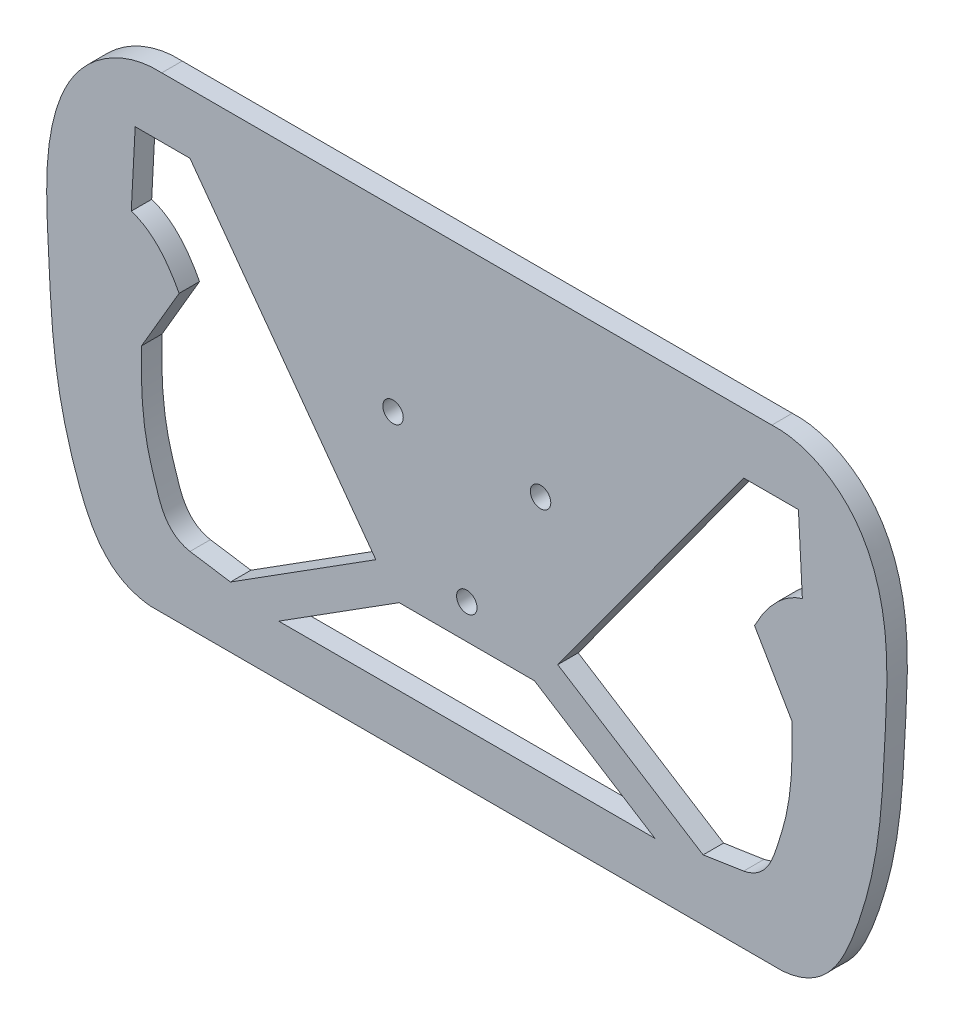
ISO-10303-21;
HEADER;
FILE_DESCRIPTION(('STEP AP214'),'2;1');
FILE_NAME('part.step','',(''),(''),'','','');
FILE_SCHEMA(('AUTOMOTIVE_DESIGN { 1 0 10303 214 1 1 1 1 }'));
ENDSEC;
DATA;
#1=APPLICATION_CONTEXT('core data for automotive mechanical design processes');
#2=APPLICATION_PROTOCOL_DEFINITION('international standard','automotive_design',2000,#1);
#3=PRODUCT_CONTEXT('',#1,'mechanical');
#4=PRODUCT('Part','Part','',(#3));
#5=PRODUCT_RELATED_PRODUCT_CATEGORY('part','',(#4));
#6=PRODUCT_DEFINITION_FORMATION('','',#4);
#7=PRODUCT_DEFINITION_CONTEXT('part definition',#1,'design');
#8=PRODUCT_DEFINITION('design','',#6,#7);
#9=PRODUCT_DEFINITION_SHAPE('','',#8);
#10=(LENGTH_UNIT() NAMED_UNIT(*) SI_UNIT(.MILLI.,.METRE.));
#11=(NAMED_UNIT(*) PLANE_ANGLE_UNIT() SI_UNIT($,.RADIAN.));
#12=(NAMED_UNIT(*) SI_UNIT($,.STERADIAN.) SOLID_ANGLE_UNIT());
#13=UNCERTAINTY_MEASURE_WITH_UNIT(LENGTH_MEASURE(1.E-05),#10,'distance_accuracy_value','');
#14=(GEOMETRIC_REPRESENTATION_CONTEXT(3) GLOBAL_UNCERTAINTY_ASSIGNED_CONTEXT((#13)) GLOBAL_UNIT_ASSIGNED_CONTEXT((#10,
#11,#12)) REPRESENTATION_CONTEXT('',''));
#15=CARTESIAN_POINT('',(0.,0.,0.));
#16=DIRECTION('',(0.,0.,1.));
#17=DIRECTION('',(1.,0.,0.));
#18=AXIS2_PLACEMENT_3D('',#15,#16,#17);
#19=CARTESIAN_POINT('',(122.634661360658,-0.641249025260309,6.));
#20=DIRECTION('',(0.,0.,1.));
#21=DIRECTION('',(1.,0.,0.));
#22=AXIS2_PLACEMENT_3D('',#19,#20,#21);
#23=PLANE('',#22);
#24=CARTESIAN_POINT('',(21.650635094611,12.5,6.));
#25=DIRECTION('',(0.,0.,1.));
#26=DIRECTION('',(1.,0.,0.));
#27=AXIS2_PLACEMENT_3D('',#24,#25,#26);
#28=CIRCLE('',#27,3.00000000000001);
#29=CARTESIAN_POINT('',(24.650635094611,12.5,6.));
#30=VERTEX_POINT('',#29);
#31=EDGE_CURVE('E433',#30,#30,#28,.T.);
#32=ORIENTED_EDGE('',*,*,#31,.F.);
#33=EDGE_LOOP('',(#32));
#34=FACE_BOUND('',#33,.T.);
#35=DIRECTION('',(-0.504883315037953,0.863187603129405,0.));
#36=VECTOR('',#35,1.);
#37=CARTESIAN_POINT('',(84.450971740374,11.2087465068864,6.));
#38=LINE('',#37,#36);
#39=CARTESIAN_POINT('',(95.4766910109148,-7.6416767621028,6.));
#40=VERTEX_POINT('',#39);
#41=CARTESIAN_POINT('',(84.450971740374,11.2087465068864,6.));
#42=VERTEX_POINT('',#41);
#43=EDGE_CURVE('E305',#40,#42,#38,.T.);
#44=ORIENTED_EDGE('',*,*,#43,.F.);
#45=CARTESIAN_POINT('',(81.2606265191885,-52.808002251328,6.));
#46=CARTESIAN_POINT('',(87.8145390836592,-51.4531260826305,6.));
#47=CARTESIAN_POINT('',(90.619630403705,-43.3006040680581,6.));
#48=CARTESIAN_POINT('',(95.5023536128132,-27.4781434991335,6.));
#49=CARTESIAN_POINT('',(95.6524020822301,-15.8577347754942,6.));
#50=CARTESIAN_POINT('',(95.4766910109148,-7.6416767621028,6.));
#51=B_SPLINE_CURVE_WITH_KNOTS('',3,(#45,#46,#47,#48,#49,#50),.UNSPECIFIED.,.F.,.F.,(4,1,1,4),
(0.,0.321849899827319,0.498947056420812,1.),.UNSPECIFIED.);
#52=CARTESIAN_POINT('',(81.2606265191884,-52.808002251328,6.));
#53=VERTEX_POINT('',#52);
#54=EDGE_CURVE('E356',#53,#40,#51,.T.);
#55=ORIENTED_EDGE('',*,*,#54,.F.);
#56=DIRECTION('',(0.988480113090915,0.151350804503217,0.));
#57=VECTOR('',#56,1.);
#58=CARTESIAN_POINT('',(69.3700327766013,-54.6286265665043,6.));
#59=LINE('',#58,#57);
#60=CARTESIAN_POINT('',(69.3700327766013,-54.6286265665043,6.));
#61=VERTEX_POINT('',#60);
#62=EDGE_CURVE('E318',#61,#53,#59,.T.);
#63=ORIENTED_EDGE('',*,*,#62,.F.);
#64=DIRECTION('',(0.844973215996909,-0.534808623946773,0.));
#65=VECTOR('',#64,1.);
#66=CARTESIAN_POINT('',(26.6942119899972,-27.6178331370871,6.));
#67=LINE('',#66,#65);
#68=CARTESIAN_POINT('',(26.6942119899972,-27.6178331370871,6.));
#69=VERTEX_POINT('',#68);
#70=EDGE_CURVE('E315',#69,#61,#67,.T.);
#71=ORIENTED_EDGE('',*,*,#70,.F.);
#72=DIRECTION('',(-0.589608563493928,-0.807689136892794,0.));
#73=VECTOR('',#72,1.);
#74=CARTESIAN_POINT('',(81.2606265191884,47.1312512270356,6.));
#75=LINE('',#74,#73);
#76=CARTESIAN_POINT('',(81.2606265191884,47.1312512270356,6.));
#77=VERTEX_POINT('',#76);
#78=EDGE_CURVE('E313',#77,#69,#75,.T.);
#79=ORIENTED_EDGE('',*,*,#78,.F.);
#80=DIRECTION('',(-1.,0.,0.));
#81=VECTOR('',#80,1.);
#82=CARTESIAN_POINT('',(97.3439499196354,47.1312512270356,6.));
#83=LINE('',#82,#81);
#84=CARTESIAN_POINT('',(97.3439499196354,47.1312512270356,6.));
#85=VERTEX_POINT('',#84);
#86=EDGE_CURVE('E311',#85,#77,#83,.T.);
#87=ORIENTED_EDGE('',*,*,#86,.F.);
#88=DIRECTION('',(-0.0523474842616533,0.998628930529992,0.));
#89=VECTOR('',#88,1.);
#90=CARTESIAN_POINT('',(97.3439499196354,47.1312512270356,6.));
#91=LINE('',#90,#89);
#92=CARTESIAN_POINT('',(98.4998721012244,25.0798126859539,6.));
#93=VERTEX_POINT('',#92);
#94=EDGE_CURVE('E304',#93,#85,#91,.T.);
#95=ORIENTED_EDGE('',*,*,#94,.F.);
#96=CARTESIAN_POINT('',(84.450971740374,11.2087465068864,6.));
#97=CARTESIAN_POINT('',(87.513780679481,17.0132915724179,6.));
#98=CARTESIAN_POINT('',(91.8936783987908,23.0577499282513,6.));
#99=CARTESIAN_POINT('',(98.4998721012244,25.0798126859539,6.));
#100=B_SPLINE_CURVE_WITH_KNOTS('',3,(#96,#97,#98,#99),.UNSPECIFIED.,.F.,.F.,(4,4),(0.,1.),.UNSPECIFIED.);
#101=EDGE_CURVE('E298',#42,#93,#100,.T.);
#102=ORIENTED_EDGE('',*,*,#101,.F.);
#103=EDGE_LOOP('',(#44,#55,#63,#71,#79,#87,#95,#102));
#104=FACE_BOUND('',#103,.T.);
#105=CARTESIAN_POINT('',(92.8418712487192,-72.5039417047034,6.));
#106=CARTESIAN_POINT('',(105.56811714284,-71.3121853731023,6.));
#107=CARTESIAN_POINT('',(114.338873962336,-53.6273241254987,6.));
#108=CARTESIAN_POINT('',(121.528600594417,-25.8175272471951,6.));
#109=CARTESIAN_POINT('',(122.771348874205,4.03813336720382,6.));
#110=CARTESIAN_POINT('',(124.422620363698,32.0211174561286,6.));
#111=CARTESIAN_POINT('',(113.814805390092,57.2845277569239,6.));
#112=CARTESIAN_POINT('',(98.9087189304596,65.2212880524899,6.));
#113=CARTESIAN_POINT('',(89.5433504103007,64.7223618911426,6.));
#114=B_SPLINE_CURVE_WITH_KNOTS('',3,(#105,#106,#107,#108,#109,#110,#111,#112,#113),
.UNSPECIFIED.,.F.,.F.,(4,1,1,1,1,1,4),(0.,0.190671726831978,0.335209527936945,0.520866190364124,
0.729221785484658,0.832795674392145,1.),.UNSPECIFIED.);
#115=CARTESIAN_POINT('',(92.8418712487192,-72.5039417047034,6.));
#116=VERTEX_POINT('',#115);
#117=CARTESIAN_POINT('',(89.5433504103007,64.7223618911426,6.));
#118=VERTEX_POINT('',#117);
#119=EDGE_CURVE('E374',#116,#118,#114,.T.);
#120=ORIENTED_EDGE('',*,*,#119,.T.);
#121=DIRECTION('',(-1.,0.,0.));
#122=VECTOR('',#121,1.);
#123=CARTESIAN_POINT('',(-89.5433504103007,64.7223618911426,6.));
#124=LINE('',#123,#122);
#125=CARTESIAN_POINT('',(-89.5433504103007,64.7223618911426,6.));
#126=VERTEX_POINT('',#125);
#127=EDGE_CURVE('E380',#118,#126,#124,.T.);
#128=ORIENTED_EDGE('',*,*,#127,.T.);
#129=CARTESIAN_POINT('',(-89.5433504103007,64.7223618911426,6.));
#130=CARTESIAN_POINT('',(-98.9087189304596,65.2212880524899,6.));
#131=CARTESIAN_POINT('',(-113.814805390092,57.2845277569239,6.));
#132=CARTESIAN_POINT('',(-124.422620363698,32.0211174561286,6.));
#133=CARTESIAN_POINT('',(-122.771348874205,4.03813336720382,6.));
#134=CARTESIAN_POINT('',(-121.528600594417,-25.8175272471951,6.));
#135=CARTESIAN_POINT('',(-114.338873962336,-53.6273241254987,6.));
#136=CARTESIAN_POINT('',(-105.56811714284,-71.3121853731023,6.));
#137=CARTESIAN_POINT('',(-92.8418712487192,-72.5039417047034,6.));
#138=B_SPLINE_CURVE_WITH_KNOTS('',3,(#129,#130,#131,#132,#133,#134,#135,#136,#137),
.UNSPECIFIED.,.F.,.F.,(4,1,1,1,1,1,4),(0.,0.167204325607855,0.270778214515342,0.479133809635876,
0.664790472063055,0.809328273168022,1.),.UNSPECIFIED.);
#139=CARTESIAN_POINT('',(-92.8418712487192,-72.5039417047034,6.));
#140=VERTEX_POINT('',#139);
#141=EDGE_CURVE('E386',#126,#140,#138,.T.);
#142=ORIENTED_EDGE('',*,*,#141,.T.);
#143=DIRECTION('',(1.,0.,0.));
#144=VECTOR('',#143,1.);
#145=CARTESIAN_POINT('',(92.8418712487192,-72.5039417047034,6.));
#146=LINE('',#145,#144);
#147=EDGE_CURVE('E391',#140,#116,#146,.T.);
#148=ORIENTED_EDGE('',*,*,#147,.T.);
#149=EDGE_LOOP('',(#120,#128,#142,#148));
#150=FACE_BOUND('',#149,.T.);
#151=CARTESIAN_POINT('',(-21.650635094611,12.5,6.));
#152=DIRECTION('',(0.,0.,1.));
#153=DIRECTION('',(1.,0.,0.));
#154=AXIS2_PLACEMENT_3D('',#151,#152,#153);
#155=CIRCLE('',#154,3.00000000000001);
#156=CARTESIAN_POINT('',(-18.650635094611,12.5,6.));
#157=VERTEX_POINT('',#156);
#158=EDGE_CURVE('E327',#157,#157,#155,.T.);
#159=ORIENTED_EDGE('',*,*,#158,.F.);
#160=EDGE_LOOP('',(#159));
#161=FACE_BOUND('',#160,.T.);
#162=CARTESIAN_POINT('',(0.,-25.,6.));
#163=DIRECTION('',(0.,0.,1.));
#164=DIRECTION('',(1.,0.,0.));
#165=AXIS2_PLACEMENT_3D('',#162,#163,#164);
#166=CIRCLE('',#165,3.);
#167=CARTESIAN_POINT('',(3.,-25.,6.));
#168=VERTEX_POINT('',#167);
#169=EDGE_CURVE('E439',#168,#168,#166,.T.);
#170=ORIENTED_EDGE('',*,*,#169,.F.);
#171=EDGE_LOOP('',(#170));
#172=FACE_BOUND('',#171,.T.);
#173=DIRECTION('',(-1.,0.,0.));
#174=VECTOR('',#173,1.);
#175=CARTESIAN_POINT('',(-19.8616144286216,-35.1279740268568,6.));
#176=LINE('',#175,#174);
#177=CARTESIAN_POINT('',(19.8616144286216,-35.1279740268568,6.));
#178=VERTEX_POINT('',#177);
#179=CARTESIAN_POINT('',(-19.8616144286216,-35.1279740268568,6.));
#180=VERTEX_POINT('',#179);
#181=EDGE_CURVE('E474',#178,#180,#176,.T.);
#182=ORIENTED_EDGE('',*,*,#181,.F.);
#183=DIRECTION('',(-0.844973215996909,0.534808623946773,0.));
#184=VECTOR('',#183,1.);
#185=CARTESIAN_POINT('',(19.8616144286216,-35.1279740268568,6.));
#186=LINE('',#185,#184);
#187=CARTESIAN_POINT('',(55.2146220713604,-57.5039417047034,6.));
#188=VERTEX_POINT('',#187);
#189=EDGE_CURVE('E461',#188,#178,#186,.T.);
#190=ORIENTED_EDGE('',*,*,#189,.F.);
#191=DIRECTION('',(1.,0.,0.));
#192=VECTOR('',#191,1.);
#193=CARTESIAN_POINT('',(55.2146220713604,-57.5039417047034,6.));
#194=LINE('',#193,#192);
#195=CARTESIAN_POINT('',(-55.2146220713604,-57.5039417047034,6.));
#196=VERTEX_POINT('',#195);
#197=EDGE_CURVE('E457',#196,#188,#194,.T.);
#198=ORIENTED_EDGE('',*,*,#197,.F.);
#199=DIRECTION('',(-0.844973215996909,-0.534808623946773,0.));
#200=VECTOR('',#199,1.);
#201=CARTESIAN_POINT('',(-19.8616144286216,-35.1279740268568,6.));
#202=LINE('',#201,#200);
#203=EDGE_CURVE('E471',#180,#196,#202,.T.);
#204=ORIENTED_EDGE('',*,*,#203,.F.);
#205=EDGE_LOOP('',(#182,#190,#198,#204));
#206=FACE_BOUND('',#205,.T.);
#207=DIRECTION('',(-0.504883315037953,-0.863187603129405,0.));
#208=VECTOR('',#207,1.);
#209=CARTESIAN_POINT('',(-84.450971740374,11.2087465068864,6.));
#210=LINE('',#209,#208);
#211=CARTESIAN_POINT('',(-84.450971740374,11.2087465068864,6.));
#212=VERTEX_POINT('',#211);
#213=CARTESIAN_POINT('',(-95.4766910109148,-7.6416767621028,6.));
#214=VERTEX_POINT('',#213);
#215=EDGE_CURVE('E203',#212,#214,#210,.T.);
#216=ORIENTED_EDGE('',*,*,#215,.F.);
#217=CARTESIAN_POINT('',(-98.4998721012244,25.0798126859539,6.));
#218=CARTESIAN_POINT('',(-91.8936783987908,23.0577499282513,6.));
#219=CARTESIAN_POINT('',(-87.5137806794809,17.0132915724179,6.));
#220=CARTESIAN_POINT('',(-84.450971740374,11.2087465068864,6.));
#221=B_SPLINE_CURVE_WITH_KNOTS('',3,(#217,#218,#219,#220),.UNSPECIFIED.,.F.,.F.,(4,4),(0.,1.),.UNSPECIFIED.);
#222=CARTESIAN_POINT('',(-98.4998721012244,25.0798126859539,6.));
#223=VERTEX_POINT('',#222);
#224=EDGE_CURVE('E195',#223,#212,#221,.T.);
#225=ORIENTED_EDGE('',*,*,#224,.F.);
#226=DIRECTION('',(-0.0523474842616533,-0.998628930529992,0.));
#227=VECTOR('',#226,1.);
#228=CARTESIAN_POINT('',(-97.3439499196354,47.1312512270356,6.));
#229=LINE('',#228,#227);
#230=CARTESIAN_POINT('',(-97.3439499196355,47.1312512270356,6.));
#231=VERTEX_POINT('',#230);
#232=EDGE_CURVE('E488',#231,#223,#229,.T.);
#233=ORIENTED_EDGE('',*,*,#232,.F.);
#234=DIRECTION('',(-1.,0.,0.));
#235=VECTOR('',#234,1.);
#236=CARTESIAN_POINT('',(-97.3439499196354,47.1312512270356,6.));
#237=LINE('',#236,#235);
#238=CARTESIAN_POINT('',(-81.2606265191884,47.1312512270356,6.));
#239=VERTEX_POINT('',#238);
#240=EDGE_CURVE('E519',#239,#231,#237,.T.);
#241=ORIENTED_EDGE('',*,*,#240,.F.);
#242=DIRECTION('',(-0.589608563493928,0.807689136892794,0.));
#243=VECTOR('',#242,1.);
#244=CARTESIAN_POINT('',(-81.2606265191884,47.1312512270356,6.));
#245=LINE('',#244,#243);
#246=CARTESIAN_POINT('',(-26.6942119899972,-27.6178331370871,6.));
#247=VERTEX_POINT('',#246);
#248=EDGE_CURVE('E521',#247,#239,#245,.T.);
#249=ORIENTED_EDGE('',*,*,#248,.F.);
#250=DIRECTION('',(0.844973215996909,0.534808623946773,0.));
#251=VECTOR('',#250,1.);
#252=CARTESIAN_POINT('',(-26.6942119899972,-27.6178331370871,6.));
#253=LINE('',#252,#251);
#254=CARTESIAN_POINT('',(-69.3700327766013,-54.6286265665043,6.));
#255=VERTEX_POINT('',#254);
#256=EDGE_CURVE('E522',#255,#247,#253,.T.);
#257=ORIENTED_EDGE('',*,*,#256,.F.);
#258=DIRECTION('',(0.988480113090915,-0.151350804503217,0.));
#259=VECTOR('',#258,1.);
#260=CARTESIAN_POINT('',(-69.3700327766013,-54.6286265665043,6.));
#261=LINE('',#260,#259);
#262=CARTESIAN_POINT('',(-81.2606265191884,-52.808002251328,6.));
#263=VERTEX_POINT('',#262);
#264=EDGE_CURVE('E218',#263,#255,#261,.T.);
#265=ORIENTED_EDGE('',*,*,#264,.F.);
#266=CARTESIAN_POINT('',(-95.4766910109148,-7.6416767621028,6.));
#267=CARTESIAN_POINT('',(-95.6524020822301,-15.8577347754942,6.));
#268=CARTESIAN_POINT('',(-95.5023536128132,-27.4781434991335,6.));
#269=CARTESIAN_POINT('',(-90.619630403705,-43.3006040680581,6.));
#270=CARTESIAN_POINT('',(-87.8145390836592,-51.4531260826305,6.));
#271=CARTESIAN_POINT('',(-81.2606265191885,-52.808002251328,6.));
#272=B_SPLINE_CURVE_WITH_KNOTS('',3,(#266,#267,#268,#269,#270,#271),.UNSPECIFIED.,.F.,.F.,(4,1,
1,4),(0.,0.501052943579188,0.678150100172681,1.),.UNSPECIFIED.);
#273=EDGE_CURVE('E216',#214,#263,#272,.T.);
#274=ORIENTED_EDGE('',*,*,#273,.F.);
#275=EDGE_LOOP('',(#216,#225,#233,#241,#249,#257,#265,#274));
#276=FACE_BOUND('',#275,.T.);
#277=ADVANCED_FACE('F33',(#34,#104,#150,#161,#172,#206,#276),#23,.T.);
#278=CARTESIAN_POINT('',(122.634661360658,-0.641249025260309,0.));
#279=DIRECTION('',(0.,0.,1.));
#280=DIRECTION('',(1.,0.,0.));
#281=AXIS2_PLACEMENT_3D('',#278,#279,#280);
#282=PLANE('',#281);
#283=DIRECTION('',(-0.844973215996909,0.534808623946773,0.));
#284=VECTOR('',#283,1.);
#285=CARTESIAN_POINT('',(19.8616144286216,-35.1279740268568,0.));
#286=LINE('',#285,#284);
#287=CARTESIAN_POINT('',(55.2146220713604,-57.5039417047034,0.));
#288=VERTEX_POINT('',#287);
#289=CARTESIAN_POINT('',(19.8616144286216,-35.1279740268568,0.));
#290=VERTEX_POINT('',#289);
#291=EDGE_CURVE('E211',#288,#290,#286,.T.);
#292=ORIENTED_EDGE('',*,*,#291,.T.);
#293=DIRECTION('',(-1.,0.,0.));
#294=VECTOR('',#293,1.);
#295=CARTESIAN_POINT('',(-19.8616144286216,-35.1279740268568,0.));
#296=LINE('',#295,#294);
#297=CARTESIAN_POINT('',(-19.8616144286216,-35.1279740268568,0.));
#298=VERTEX_POINT('',#297);
#299=EDGE_CURVE('E465',#290,#298,#296,.T.);
#300=ORIENTED_EDGE('',*,*,#299,.T.);
#301=DIRECTION('',(-0.844973215996909,-0.534808623946773,0.));
#302=VECTOR('',#301,1.);
#303=CARTESIAN_POINT('',(-19.8616144286216,-35.1279740268568,0.));
#304=LINE('',#303,#302);
#305=CARTESIAN_POINT('',(-55.2146220713604,-57.5039417047034,0.));
#306=VERTEX_POINT('',#305);
#307=EDGE_CURVE('E462',#298,#306,#304,.T.);
#308=ORIENTED_EDGE('',*,*,#307,.T.);
#309=DIRECTION('',(1.,0.,0.));
#310=VECTOR('',#309,1.);
#311=CARTESIAN_POINT('',(55.2146220713604,-57.5039417047034,0.));
#312=LINE('',#311,#310);
#313=EDGE_CURVE('E458',#306,#288,#312,.T.);
#314=ORIENTED_EDGE('',*,*,#313,.T.);
#315=EDGE_LOOP('',(#292,#300,#308,#314));
#316=FACE_BOUND('',#315,.T.);
#317=CARTESIAN_POINT('',(92.8418712487192,-72.5039417047034,0.));
#318=CARTESIAN_POINT('',(105.56811714284,-71.3121853731023,0.));
#319=CARTESIAN_POINT('',(114.338873962336,-53.6273241254987,0.));
#320=CARTESIAN_POINT('',(121.528600594417,-25.8175272471951,0.));
#321=CARTESIAN_POINT('',(122.771348874205,4.03813336720382,0.));
#322=CARTESIAN_POINT('',(124.422620363698,32.0211174561286,0.));
#323=CARTESIAN_POINT('',(113.814805390092,57.2845277569239,0.));
#324=CARTESIAN_POINT('',(98.9087189304596,65.2212880524899,0.));
#325=CARTESIAN_POINT('',(89.5433504103007,64.7223618911426,0.));
#326=B_SPLINE_CURVE_WITH_KNOTS('',3,(#317,#318,#319,#320,#321,#322,#323,#324,#325),
.UNSPECIFIED.,.F.,.F.,(4,1,1,1,1,1,4),(0.,0.190671726831978,0.335209527936945,0.520866190364124,
0.729221785484658,0.832795674392145,1.),.UNSPECIFIED.);
#327=CARTESIAN_POINT('',(92.8418712487192,-72.5039417047034,0.));
#328=VERTEX_POINT('',#327);
#329=CARTESIAN_POINT('',(89.5433504103007,64.7223618911426,0.));
#330=VERTEX_POINT('',#329);
#331=EDGE_CURVE('E373',#328,#330,#326,.T.);
#332=ORIENTED_EDGE('',*,*,#331,.F.);
#333=DIRECTION('',(1.,0.,0.));
#334=VECTOR('',#333,1.);
#335=CARTESIAN_POINT('',(92.8418712487192,-72.5039417047034,0.));
#336=LINE('',#335,#334);
#337=CARTESIAN_POINT('',(-92.8418712487192,-72.5039417047034,0.));
#338=VERTEX_POINT('',#337);
#339=EDGE_CURVE('E381',#338,#328,#336,.T.);
#340=ORIENTED_EDGE('',*,*,#339,.F.);
#341=CARTESIAN_POINT('',(-89.5433504103007,64.7223618911426,0.));
#342=CARTESIAN_POINT('',(-98.9087189304596,65.2212880524899,0.));
#343=CARTESIAN_POINT('',(-113.814805390092,57.2845277569239,0.));
#344=CARTESIAN_POINT('',(-124.422620363698,32.0211174561286,0.));
#345=CARTESIAN_POINT('',(-122.771348874205,4.03813336720382,0.));
#346=CARTESIAN_POINT('',(-121.528600594417,-25.8175272471951,0.));
#347=CARTESIAN_POINT('',(-114.338873962336,-53.6273241254987,0.));
#348=CARTESIAN_POINT('',(-105.56811714284,-71.3121853731023,0.));
#349=CARTESIAN_POINT('',(-92.8418712487192,-72.5039417047034,0.));
#350=B_SPLINE_CURVE_WITH_KNOTS('',3,(#341,#342,#343,#344,#345,#346,#347,#348,#349),
.UNSPECIFIED.,.F.,.F.,(4,1,1,1,1,1,4),(0.,0.167204325607855,0.270778214515342,0.479133809635876,
0.664790472063055,0.809328273168022,1.),.UNSPECIFIED.);
#351=CARTESIAN_POINT('',(-89.5433504103007,64.7223618911426,0.));
#352=VERTEX_POINT('',#351);
#353=EDGE_CURVE('E738',#352,#338,#350,.T.);
#354=ORIENTED_EDGE('',*,*,#353,.F.);
#355=DIRECTION('',(-1.,0.,0.));
#356=VECTOR('',#355,1.);
#357=CARTESIAN_POINT('',(-89.5433504103007,64.7223618911426,0.));
#358=LINE('',#357,#356);
#359=EDGE_CURVE('E744',#330,#352,#358,.T.);
#360=ORIENTED_EDGE('',*,*,#359,.F.);
#361=EDGE_LOOP('',(#332,#340,#354,#360));
#362=FACE_BOUND('',#361,.T.);
#363=CARTESIAN_POINT('',(81.2606265191885,-52.808002251328,0.));
#364=CARTESIAN_POINT('',(87.8145390836592,-51.4531260826305,0.));
#365=CARTESIAN_POINT('',(90.619630403705,-43.3006040680581,0.));
#366=CARTESIAN_POINT('',(95.5023536128132,-27.4781434991335,0.));
#367=CARTESIAN_POINT('',(95.6524020822301,-15.8577347754942,0.));
#368=CARTESIAN_POINT('',(95.4766910109148,-7.6416767621028,0.));
#369=B_SPLINE_CURVE_WITH_KNOTS('',3,(#363,#364,#365,#366,#367,#368),.UNSPECIFIED.,.F.,.F.,(4,1,
1,4),(0.,0.321849899827319,0.498947056420812,1.),.UNSPECIFIED.);
#370=CARTESIAN_POINT('',(81.2606265191884,-52.808002251328,0.));
#371=VERTEX_POINT('',#370);
#372=CARTESIAN_POINT('',(95.4766910109148,-7.6416767621028,0.));
#373=VERTEX_POINT('',#372);
#374=EDGE_CURVE('E321',#371,#373,#369,.T.);
#375=ORIENTED_EDGE('',*,*,#374,.T.);
#376=DIRECTION('',(-0.504883315037953,0.863187603129405,0.));
#377=VECTOR('',#376,1.);
#378=CARTESIAN_POINT('',(84.450971740374,11.2087465068864,0.));
#379=LINE('',#378,#377);
#380=CARTESIAN_POINT('',(84.450971740374,11.2087465068864,0.));
#381=VERTEX_POINT('',#380);
#382=EDGE_CURVE('E326',#373,#381,#379,.T.);
#383=ORIENTED_EDGE('',*,*,#382,.T.);
#384=CARTESIAN_POINT('',(84.450971740374,11.2087465068864,0.));
#385=CARTESIAN_POINT('',(87.513780679481,17.0132915724179,0.));
#386=CARTESIAN_POINT('',(91.8936783987908,23.0577499282513,0.));
#387=CARTESIAN_POINT('',(98.4998721012244,25.0798126859539,0.));
#388=B_SPLINE_CURVE_WITH_KNOTS('',3,(#384,#385,#386,#387),.UNSPECIFIED.,.F.,.F.,(4,4),(0.,1.),.UNSPECIFIED.);
#389=CARTESIAN_POINT('',(98.4998721012244,25.0798126859539,0.));
#390=VERTEX_POINT('',#389);
#391=EDGE_CURVE('E333',#381,#390,#388,.T.);
#392=ORIENTED_EDGE('',*,*,#391,.T.);
#393=DIRECTION('',(-0.0523474842616533,0.998628930529992,0.));
#394=VECTOR('',#393,1.);
#395=CARTESIAN_POINT('',(97.3439499196354,47.1312512270356,0.));
#396=LINE('',#395,#394);
#397=CARTESIAN_POINT('',(97.3439499196354,47.1312512270356,0.));
#398=VERTEX_POINT('',#397);
#399=EDGE_CURVE('E338',#390,#398,#396,.T.);
#400=ORIENTED_EDGE('',*,*,#399,.T.);
#401=DIRECTION('',(-1.,0.,0.));
#402=VECTOR('',#401,1.);
#403=CARTESIAN_POINT('',(97.3439499196354,47.1312512270356,0.));
#404=LINE('',#403,#402);
#405=CARTESIAN_POINT('',(81.2606265191884,47.1312512270356,0.));
#406=VERTEX_POINT('',#405);
#407=EDGE_CURVE('E344',#398,#406,#404,.T.);
#408=ORIENTED_EDGE('',*,*,#407,.T.);
#409=DIRECTION('',(-0.589608563493928,-0.807689136892794,0.));
#410=VECTOR('',#409,1.);
#411=CARTESIAN_POINT('',(81.2606265191884,47.1312512270356,0.));
#412=LINE('',#411,#410);
#413=CARTESIAN_POINT('',(26.6942119899972,-27.6178331370871,0.));
#414=VERTEX_POINT('',#413);
#415=EDGE_CURVE('E347',#406,#414,#412,.T.);
#416=ORIENTED_EDGE('',*,*,#415,.T.);
#417=DIRECTION('',(0.844973215996909,-0.534808623946773,0.));
#418=VECTOR('',#417,1.);
#419=CARTESIAN_POINT('',(26.6942119899972,-27.6178331370871,0.));
#420=LINE('',#419,#418);
#421=CARTESIAN_POINT('',(69.3700327766013,-54.6286265665043,0.));
#422=VERTEX_POINT('',#421);
#423=EDGE_CURVE('E350',#414,#422,#420,.T.);
#424=ORIENTED_EDGE('',*,*,#423,.T.);
#425=DIRECTION('',(0.988480113090915,0.151350804503217,0.));
#426=VECTOR('',#425,1.);
#427=CARTESIAN_POINT('',(69.3700327766013,-54.6286265665043,0.));
#428=LINE('',#427,#426);
#429=EDGE_CURVE('E353',#422,#371,#428,.T.);
#430=ORIENTED_EDGE('',*,*,#429,.T.);
#431=EDGE_LOOP('',(#375,#383,#392,#400,#408,#416,#424,#430));
#432=FACE_BOUND('',#431,.T.);
#433=CARTESIAN_POINT('',(-21.650635094611,12.5,0.));
#434=DIRECTION('',(0.,0.,1.));
#435=DIRECTION('',(1.,0.,0.));
#436=AXIS2_PLACEMENT_3D('',#433,#434,#435);
#437=CIRCLE('',#436,3.00000000000001);
#438=CARTESIAN_POINT('',(-18.650635094611,12.5,0.));
#439=VERTEX_POINT('',#438);
#440=EDGE_CURVE('E427',#439,#439,#437,.T.);
#441=ORIENTED_EDGE('',*,*,#440,.T.);
#442=EDGE_LOOP('',(#441));
#443=FACE_BOUND('',#442,.T.);
#444=CARTESIAN_POINT('',(21.650635094611,12.5,0.));
#445=DIRECTION('',(0.,0.,1.));
#446=DIRECTION('',(1.,0.,0.));
#447=AXIS2_PLACEMENT_3D('',#444,#445,#446);
#448=CIRCLE('',#447,3.00000000000001);
#449=CARTESIAN_POINT('',(24.650635094611,12.5,0.));
#450=VERTEX_POINT('',#449);
#451=EDGE_CURVE('E436',#450,#450,#448,.T.);
#452=ORIENTED_EDGE('',*,*,#451,.T.);
#453=EDGE_LOOP('',(#452));
#454=FACE_BOUND('',#453,.T.);
#455=CARTESIAN_POINT('',(0.,-25.,0.));
#456=DIRECTION('',(0.,0.,1.));
#457=DIRECTION('',(1.,0.,0.));
#458=AXIS2_PLACEMENT_3D('',#455,#456,#457);
#459=CIRCLE('',#458,3.);
#460=CARTESIAN_POINT('',(3.,-25.,0.));
#461=VERTEX_POINT('',#460);
#462=EDGE_CURVE('E442',#461,#461,#459,.T.);
#463=ORIENTED_EDGE('',*,*,#462,.T.);
#464=EDGE_LOOP('',(#463));
#465=FACE_BOUND('',#464,.T.);
#466=CARTESIAN_POINT('',(-98.4998721012244,25.0798126859539,0.));
#467=CARTESIAN_POINT('',(-91.8936783987908,23.0577499282513,0.));
#468=CARTESIAN_POINT('',(-87.5137806794809,17.0132915724179,0.));
#469=CARTESIAN_POINT('',(-84.450971740374,11.2087465068864,0.));
#470=B_SPLINE_CURVE_WITH_KNOTS('',3,(#466,#467,#468,#469),.UNSPECIFIED.,.F.,.F.,(4,4),(0.,1.),.UNSPECIFIED.);
#471=CARTESIAN_POINT('',(-98.4998721012244,25.0798126859539,0.));
#472=VERTEX_POINT('',#471);
#473=CARTESIAN_POINT('',(-84.450971740374,11.2087465068864,0.));
#474=VERTEX_POINT('',#473);
#475=EDGE_CURVE('E57',#472,#474,#470,.T.);
#476=ORIENTED_EDGE('',*,*,#475,.T.);
#477=DIRECTION('',(-0.504883315037953,-0.863187603129405,0.));
#478=VECTOR('',#477,1.);
#479=CARTESIAN_POINT('',(-84.450971740374,11.2087465068864,0.));
#480=LINE('',#479,#478);
#481=CARTESIAN_POINT('',(-95.4766910109148,-7.6416767621028,0.));
#482=VERTEX_POINT('',#481);
#483=EDGE_CURVE('E210',#474,#482,#480,.T.);
#484=ORIENTED_EDGE('',*,*,#483,.T.);
#485=CARTESIAN_POINT('',(-95.4766910109148,-7.6416767621028,0.));
#486=CARTESIAN_POINT('',(-95.6524020822301,-15.8577347754942,0.));
#487=CARTESIAN_POINT('',(-95.5023536128132,-27.4781434991335,0.));
#488=CARTESIAN_POINT('',(-90.619630403705,-43.3006040680581,0.));
#489=CARTESIAN_POINT('',(-87.8145390836592,-51.4531260826305,0.));
#490=CARTESIAN_POINT('',(-81.2606265191885,-52.808002251328,0.));
#491=B_SPLINE_CURVE_WITH_KNOTS('',3,(#485,#486,#487,#488,#489,#490),.UNSPECIFIED.,.F.,.F.,(4,1,
1,4),(0.,0.501052943579188,0.678150100172681,1.),.UNSPECIFIED.);
#492=CARTESIAN_POINT('',(-81.2606265191884,-52.808002251328,0.));
#493=VERTEX_POINT('',#492);
#494=EDGE_CURVE('E503',#482,#493,#491,.T.);
#495=ORIENTED_EDGE('',*,*,#494,.T.);
#496=DIRECTION('',(0.988480113090915,-0.151350804503217,0.));
#497=VECTOR('',#496,1.);
#498=CARTESIAN_POINT('',(-69.3700327766013,-54.6286265665043,0.));
#499=LINE('',#498,#497);
#500=CARTESIAN_POINT('',(-69.3700327766013,-54.6286265665043,0.));
#501=VERTEX_POINT('',#500);
#502=EDGE_CURVE('E500',#493,#501,#499,.T.);
#503=ORIENTED_EDGE('',*,*,#502,.T.);
#504=DIRECTION('',(0.844973215996909,0.534808623946773,0.));
#505=VECTOR('',#504,1.);
#506=CARTESIAN_POINT('',(-26.6942119899972,-27.6178331370871,0.));
#507=LINE('',#506,#505);
#508=CARTESIAN_POINT('',(-26.6942119899972,-27.6178331370871,0.));
#509=VERTEX_POINT('',#508);
#510=EDGE_CURVE('E497',#501,#509,#507,.T.);
#511=ORIENTED_EDGE('',*,*,#510,.T.);
#512=DIRECTION('',(-0.589608563493928,0.807689136892794,0.));
#513=VECTOR('',#512,1.);
#514=CARTESIAN_POINT('',(-81.2606265191884,47.1312512270356,0.));
#515=LINE('',#514,#513);
#516=CARTESIAN_POINT('',(-81.2606265191884,47.1312512270356,0.));
#517=VERTEX_POINT('',#516);
#518=EDGE_CURVE('E494',#509,#517,#515,.T.);
#519=ORIENTED_EDGE('',*,*,#518,.T.);
#520=DIRECTION('',(-1.,0.,0.));
#521=VECTOR('',#520,1.);
#522=CARTESIAN_POINT('',(-97.3439499196354,47.1312512270356,0.));
#523=LINE('',#522,#521);
#524=CARTESIAN_POINT('',(-97.3439499196354,47.1312512270356,0.));
#525=VERTEX_POINT('',#524);
#526=EDGE_CURVE('E491',#517,#525,#523,.T.);
#527=ORIENTED_EDGE('',*,*,#526,.T.);
#528=DIRECTION('',(-0.0523474842616533,-0.998628930529992,0.));
#529=VECTOR('',#528,1.);
#530=CARTESIAN_POINT('',(-97.3439499196354,47.1312512270356,0.));
#531=LINE('',#530,#529);
#532=EDGE_CURVE('E204',#525,#472,#531,.T.);
#533=ORIENTED_EDGE('',*,*,#532,.T.);
#534=EDGE_LOOP('',(#476,#484,#495,#503,#511,#519,#527,#533));
#535=FACE_BOUND('',#534,.T.);
#536=ADVANCED_FACE('F409',(#316,#362,#432,#443,#454,#465,#535),#282,.F.);
#537=DIRECTION('',(0.,0.,-1.));
#538=VECTOR('',#537,1.);
#539=SURFACE_OF_LINEAR_EXTRUSION('',#114,#538);
#540=ORIENTED_EDGE('',*,*,#331,.T.);
#541=DIRECTION('',(0.,0.,-1.));
#542=VECTOR('',#541,1.);
#543=CARTESIAN_POINT('',(89.5433504103007,64.7223618911426,6.));
#544=LINE('',#543,#542);
#545=EDGE_CURVE('E11',#118,#330,#544,.T.);
#546=ORIENTED_EDGE('',*,*,#545,.F.);
#547=ORIENTED_EDGE('',*,*,#119,.F.);
#548=DIRECTION('',(0.,0.,-1.));
#549=VECTOR('',#548,1.);
#550=CARTESIAN_POINT('',(92.8418712487192,-72.5039417047034,6.));
#551=LINE('',#550,#549);
#552=EDGE_CURVE('E731',#116,#328,#551,.T.);
#553=ORIENTED_EDGE('',*,*,#552,.T.);
#554=EDGE_LOOP('',(#540,#546,#547,#553));
#555=FACE_BOUND('',#554,.T.);
#556=ADVANCED_FACE('F35',(#555),#539,.F.);
#557=CARTESIAN_POINT('',(-89.5433504103007,64.7223618911426,6.));
#558=DIRECTION('',(0.,-1.,0.));
#559=DIRECTION('',(0.,0.,-1.));
#560=AXIS2_PLACEMENT_3D('',#557,#558,#559);
#561=PLANE('',#560);
#562=ORIENTED_EDGE('',*,*,#359,.T.);
#563=DIRECTION('',(0.,0.,-1.));
#564=VECTOR('',#563,1.);
#565=CARTESIAN_POINT('',(-89.5433504103007,64.7223618911426,6.));
#566=LINE('',#565,#564);
#567=EDGE_CURVE('E42',#126,#352,#566,.T.);
#568=ORIENTED_EDGE('',*,*,#567,.F.);
#569=ORIENTED_EDGE('',*,*,#127,.F.);
#570=ORIENTED_EDGE('',*,*,#545,.T.);
#571=EDGE_LOOP('',(#562,#568,#569,#570));
#572=FACE_BOUND('',#571,.T.);
#573=ADVANCED_FACE('F401',(#572),#561,.F.);
#574=DIRECTION('',(0.,0.,-1.));
#575=VECTOR('',#574,1.);
#576=SURFACE_OF_LINEAR_EXTRUSION('',#138,#575);
#577=ORIENTED_EDGE('',*,*,#353,.T.);
#578=DIRECTION('',(0.,0.,-1.));
#579=VECTOR('',#578,1.);
#580=CARTESIAN_POINT('',(-92.8418712487192,-72.5039417047034,6.));
#581=LINE('',#580,#579);
#582=EDGE_CURVE('E734',#140,#338,#581,.T.);
#583=ORIENTED_EDGE('',*,*,#582,.F.);
#584=ORIENTED_EDGE('',*,*,#141,.F.);
#585=ORIENTED_EDGE('',*,*,#567,.T.);
#586=EDGE_LOOP('',(#577,#583,#584,#585));
#587=FACE_BOUND('',#586,.T.);
#588=ADVANCED_FACE('F397',(#587),#576,.F.);
#589=CARTESIAN_POINT('',(92.8418712487192,-72.5039417047034,6.));
#590=DIRECTION('',(0.,1.,0.));
#591=DIRECTION('',(0.,0.,1.));
#592=AXIS2_PLACEMENT_3D('',#589,#590,#591);
#593=PLANE('',#592);
#594=ORIENTED_EDGE('',*,*,#339,.T.);
#595=ORIENTED_EDGE('',*,*,#552,.F.);
#596=ORIENTED_EDGE('',*,*,#147,.F.);
#597=ORIENTED_EDGE('',*,*,#582,.T.);
#598=EDGE_LOOP('',(#594,#595,#596,#597));
#599=FACE_BOUND('',#598,.T.);
#600=ADVANCED_FACE('F400',(#599),#593,.F.);
#601=DIRECTION('',(0.,0.,-1.));
#602=VECTOR('',#601,1.);
#603=SURFACE_OF_LINEAR_EXTRUSION('',#51,#602);
#604=ORIENTED_EDGE('',*,*,#374,.F.);
#605=DIRECTION('',(0.,0.,-1.));
#606=VECTOR('',#605,1.);
#607=CARTESIAN_POINT('',(81.2606265191884,-52.808002251328,6.));
#608=LINE('',#607,#606);
#609=EDGE_CURVE('E320',#53,#371,#608,.T.);
#610=ORIENTED_EDGE('',*,*,#609,.F.);
#611=ORIENTED_EDGE('',*,*,#54,.T.);
#612=DIRECTION('',(0.,0.,-1.));
#613=VECTOR('',#612,1.);
#614=CARTESIAN_POINT('',(95.4766910109148,-7.6416767621028,6.));
#615=LINE('',#614,#613);
#616=EDGE_CURVE('E371',#40,#373,#615,.T.);
#617=ORIENTED_EDGE('',*,*,#616,.T.);
#618=EDGE_LOOP('',(#604,#610,#611,#617));
#619=FACE_BOUND('',#618,.T.);
#620=ADVANCED_FACE('F420',(#619),#603,.T.);
#621=CARTESIAN_POINT('',(84.450971740374,11.2087465068864,6.));
#622=DIRECTION('',(-0.863187603129405,-0.504883315037953,0.));
#623=DIRECTION('',(0.504883315037953,-0.863187603129405,0.));
#624=AXIS2_PLACEMENT_3D('',#621,#622,#623);
#625=PLANE('',#624);
#626=ORIENTED_EDGE('',*,*,#382,.F.);
#627=ORIENTED_EDGE('',*,*,#616,.F.);
#628=ORIENTED_EDGE('',*,*,#43,.T.);
#629=DIRECTION('',(0.,0.,-1.));
#630=VECTOR('',#629,1.);
#631=CARTESIAN_POINT('',(84.450971740374,11.2087465068864,6.));
#632=LINE('',#631,#630);
#633=EDGE_CURVE('E369',#42,#381,#632,.T.);
#634=ORIENTED_EDGE('',*,*,#633,.T.);
#635=EDGE_LOOP('',(#626,#627,#628,#634));
#636=FACE_BOUND('',#635,.T.);
#637=ADVANCED_FACE('F295',(#636),#625,.T.);
#638=DIRECTION('',(0.,0.,-1.));
#639=VECTOR('',#638,1.);
#640=SURFACE_OF_LINEAR_EXTRUSION('',#100,#639);
#641=ORIENTED_EDGE('',*,*,#391,.F.);
#642=ORIENTED_EDGE('',*,*,#633,.F.);
#643=ORIENTED_EDGE('',*,*,#101,.T.);
#644=DIRECTION('',(0.,0.,-1.));
#645=VECTOR('',#644,1.);
#646=CARTESIAN_POINT('',(98.4998721012244,25.0798126859539,6.));
#647=LINE('',#646,#645);
#648=EDGE_CURVE('E367',#93,#390,#647,.T.);
#649=ORIENTED_EDGE('',*,*,#648,.T.);
#650=EDGE_LOOP('',(#641,#642,#643,#649));
#651=FACE_BOUND('',#650,.T.);
#652=ADVANCED_FACE('F290',(#651),#640,.T.);
#653=CARTESIAN_POINT('',(97.3439499196354,47.1312512270356,6.));
#654=DIRECTION('',(-0.998628930529992,-0.0523474842616532,0.));
#655=DIRECTION('',(0.0523474842616533,-0.998628930529992,0.));
#656=AXIS2_PLACEMENT_3D('',#653,#654,#655);
#657=PLANE('',#656);
#658=ORIENTED_EDGE('',*,*,#399,.F.);
#659=ORIENTED_EDGE('',*,*,#648,.F.);
#660=ORIENTED_EDGE('',*,*,#94,.T.);
#661=DIRECTION('',(0.,0.,-1.));
#662=VECTOR('',#661,1.);
#663=CARTESIAN_POINT('',(97.3439499196354,47.1312512270356,6.));
#664=LINE('',#663,#662);
#665=EDGE_CURVE('E365',#85,#398,#664,.T.);
#666=ORIENTED_EDGE('',*,*,#665,.T.);
#667=EDGE_LOOP('',(#658,#659,#660,#666));
#668=FACE_BOUND('',#667,.T.);
#669=ADVANCED_FACE('F286',(#668),#657,.T.);
#670=CARTESIAN_POINT('',(97.3439499196354,47.1312512270356,6.));
#671=DIRECTION('',(0.,-1.,0.));
#672=DIRECTION('',(0.,0.,-1.));
#673=AXIS2_PLACEMENT_3D('',#670,#671,#672);
#674=PLANE('',#673);
#675=ORIENTED_EDGE('',*,*,#407,.F.);
#676=ORIENTED_EDGE('',*,*,#665,.F.);
#677=ORIENTED_EDGE('',*,*,#86,.T.);
#678=DIRECTION('',(0.,0.,-1.));
#679=VECTOR('',#678,1.);
#680=CARTESIAN_POINT('',(81.2606265191884,47.1312512270356,6.));
#681=LINE('',#680,#679);
#682=EDGE_CURVE('E363',#77,#406,#681,.T.);
#683=ORIENTED_EDGE('',*,*,#682,.T.);
#684=EDGE_LOOP('',(#675,#676,#677,#683));
#685=FACE_BOUND('',#684,.T.);
#686=ADVANCED_FACE('F282',(#685),#674,.T.);
#687=CARTESIAN_POINT('',(81.2606265191884,47.1312512270356,6.));
#688=DIRECTION('',(0.807689136892794,-0.589608563493928,0.));
#689=DIRECTION('',(0.589608563493928,0.807689136892794,0.));
#690=AXIS2_PLACEMENT_3D('',#687,#688,#689);
#691=PLANE('',#690);
#692=ORIENTED_EDGE('',*,*,#415,.F.);
#693=ORIENTED_EDGE('',*,*,#682,.F.);
#694=ORIENTED_EDGE('',*,*,#78,.T.);
#695=DIRECTION('',(0.,0.,-1.));
#696=VECTOR('',#695,1.);
#697=CARTESIAN_POINT('',(26.6942119899972,-27.6178331370871,6.));
#698=LINE('',#697,#696);
#699=EDGE_CURVE('E361',#69,#414,#698,.T.);
#700=ORIENTED_EDGE('',*,*,#699,.T.);
#701=EDGE_LOOP('',(#692,#693,#694,#700));
#702=FACE_BOUND('',#701,.T.);
#703=ADVANCED_FACE('F278',(#702),#691,.T.);
#704=CARTESIAN_POINT('',(26.6942119899972,-27.6178331370871,6.));
#705=DIRECTION('',(0.534808623946773,0.844973215996909,0.));
#706=DIRECTION('',(-0.844973215996909,0.534808623946773,0.));
#707=AXIS2_PLACEMENT_3D('',#704,#705,#706);
#708=PLANE('',#707);
#709=ORIENTED_EDGE('',*,*,#423,.F.);
#710=ORIENTED_EDGE('',*,*,#699,.F.);
#711=ORIENTED_EDGE('',*,*,#70,.T.);
#712=DIRECTION('',(0.,0.,-1.));
#713=VECTOR('',#712,1.);
#714=CARTESIAN_POINT('',(69.3700327766013,-54.6286265665043,6.));
#715=LINE('',#714,#713);
#716=EDGE_CURVE('E359',#61,#422,#715,.T.);
#717=ORIENTED_EDGE('',*,*,#716,.T.);
#718=EDGE_LOOP('',(#709,#710,#711,#717));
#719=FACE_BOUND('',#718,.T.);
#720=ADVANCED_FACE('F274',(#719),#708,.T.);
#721=CARTESIAN_POINT('',(69.3700327766013,-54.6286265665043,6.));
#722=DIRECTION('',(-0.151350804503217,0.988480113090915,0.));
#723=DIRECTION('',(-0.988480113090915,-0.151350804503217,0.));
#724=AXIS2_PLACEMENT_3D('',#721,#722,#723);
#725=PLANE('',#724);
#726=ORIENTED_EDGE('',*,*,#429,.F.);
#727=ORIENTED_EDGE('',*,*,#716,.F.);
#728=ORIENTED_EDGE('',*,*,#62,.T.);
#729=ORIENTED_EDGE('',*,*,#609,.T.);
#730=EDGE_LOOP('',(#726,#727,#728,#729));
#731=FACE_BOUND('',#730,.T.);
#732=ADVANCED_FACE('F270',(#731),#725,.T.);
#733=CARTESIAN_POINT('',(-21.650635094611,12.5,6.));
#734=DIRECTION('',(0.,0.,-1.));
#735=DIRECTION('',(-1.,0.,0.));
#736=AXIS2_PLACEMENT_3D('',#733,#734,#735);
#737=CYLINDRICAL_SURFACE('',#736,3.00000000000001);
#738=ORIENTED_EDGE('',*,*,#158,.T.);
#739=EDGE_LOOP('',(#738));
#740=FACE_BOUND('',#739,.T.);
#741=ORIENTED_EDGE('',*,*,#440,.F.);
#742=EDGE_LOOP('',(#741));
#743=FACE_BOUND('',#742,.T.);
#744=ADVANCED_FACE('F266',(#740,#743),#737,.F.);
#745=CARTESIAN_POINT('',(21.650635094611,12.5,6.));
#746=DIRECTION('',(0.,0.,-1.));
#747=DIRECTION('',(-1.,0.,0.));
#748=AXIS2_PLACEMENT_3D('',#745,#746,#747);
#749=CYLINDRICAL_SURFACE('',#748,3.00000000000001);
#750=ORIENTED_EDGE('',*,*,#31,.T.);
#751=EDGE_LOOP('',(#750));
#752=FACE_BOUND('',#751,.T.);
#753=ORIENTED_EDGE('',*,*,#451,.F.);
#754=EDGE_LOOP('',(#753));
#755=FACE_BOUND('',#754,.T.);
#756=ADVANCED_FACE('F262',(#752,#755),#749,.F.);
#757=CARTESIAN_POINT('',(0.,-25.,6.));
#758=DIRECTION('',(0.,0.,-1.));
#759=DIRECTION('',(-1.,0.,0.));
#760=AXIS2_PLACEMENT_3D('',#757,#758,#759);
#761=CYLINDRICAL_SURFACE('',#760,3.);
#762=ORIENTED_EDGE('',*,*,#169,.T.);
#763=EDGE_LOOP('',(#762));
#764=FACE_BOUND('',#763,.T.);
#765=ORIENTED_EDGE('',*,*,#462,.F.);
#766=EDGE_LOOP('',(#765));
#767=FACE_BOUND('',#766,.T.);
#768=ADVANCED_FACE('F258',(#764,#767),#761,.F.);
#769=CARTESIAN_POINT('',(19.8616144286216,-35.1279740268568,6.));
#770=DIRECTION('',(-0.534808623946773,-0.844973215996909,0.));
#771=DIRECTION('',(0.844973215996909,-0.534808623946773,0.));
#772=AXIS2_PLACEMENT_3D('',#769,#770,#771);
#773=PLANE('',#772);
#774=ORIENTED_EDGE('',*,*,#291,.F.);
#775=DIRECTION('',(0.,0.,-1.));
#776=VECTOR('',#775,1.);
#777=CARTESIAN_POINT('',(55.2146220713604,-57.5039417047034,6.));
#778=LINE('',#777,#776);
#779=EDGE_CURVE('E454',#188,#288,#778,.T.);
#780=ORIENTED_EDGE('',*,*,#779,.F.);
#781=ORIENTED_EDGE('',*,*,#189,.T.);
#782=DIRECTION('',(0.,0.,-1.));
#783=VECTOR('',#782,1.);
#784=CARTESIAN_POINT('',(19.8616144286216,-35.1279740268568,6.));
#785=LINE('',#784,#783);
#786=EDGE_CURVE('E445',#178,#290,#785,.T.);
#787=ORIENTED_EDGE('',*,*,#786,.T.);
#788=EDGE_LOOP('',(#774,#780,#781,#787));
#789=FACE_BOUND('',#788,.T.);
#790=ADVANCED_FACE('F254',(#789),#773,.T.);
#791=CARTESIAN_POINT('',(-19.8616144286216,-35.1279740268568,6.));
#792=DIRECTION('',(0.,-1.,0.));
#793=DIRECTION('',(0.,0.,-1.));
#794=AXIS2_PLACEMENT_3D('',#791,#792,#793);
#795=PLANE('',#794);
#796=ORIENTED_EDGE('',*,*,#299,.F.);
#797=ORIENTED_EDGE('',*,*,#786,.F.);
#798=ORIENTED_EDGE('',*,*,#181,.T.);
#799=DIRECTION('',(0.,0.,-1.));
#800=VECTOR('',#799,1.);
#801=CARTESIAN_POINT('',(-19.8616144286216,-35.1279740268568,6.));
#802=LINE('',#801,#800);
#803=EDGE_CURVE('E450',#180,#298,#802,.T.);
#804=ORIENTED_EDGE('',*,*,#803,.T.);
#805=EDGE_LOOP('',(#796,#797,#798,#804));
#806=FACE_BOUND('',#805,.T.);
#807=ADVANCED_FACE('F250',(#806),#795,.T.);
#808=CARTESIAN_POINT('',(-19.8616144286216,-35.1279740268568,6.));
#809=DIRECTION('',(0.534808623946773,-0.844973215996909,0.));
#810=DIRECTION('',(0.844973215996909,0.534808623946773,0.));
#811=AXIS2_PLACEMENT_3D('',#808,#809,#810);
#812=PLANE('',#811);
#813=ORIENTED_EDGE('',*,*,#307,.F.);
#814=ORIENTED_EDGE('',*,*,#803,.F.);
#815=ORIENTED_EDGE('',*,*,#203,.T.);
#816=DIRECTION('',(0.,0.,-1.));
#817=VECTOR('',#816,1.);
#818=CARTESIAN_POINT('',(-55.2146220713604,-57.5039417047034,6.));
#819=LINE('',#818,#817);
#820=EDGE_CURVE('E452',#196,#306,#819,.T.);
#821=ORIENTED_EDGE('',*,*,#820,.T.);
#822=EDGE_LOOP('',(#813,#814,#815,#821));
#823=FACE_BOUND('',#822,.T.);
#824=ADVANCED_FACE('F246',(#823),#812,.T.);
#825=CARTESIAN_POINT('',(55.2146220713604,-57.5039417047034,6.));
#826=DIRECTION('',(0.,1.,0.));
#827=DIRECTION('',(0.,0.,1.));
#828=AXIS2_PLACEMENT_3D('',#825,#826,#827);
#829=PLANE('',#828);
#830=ORIENTED_EDGE('',*,*,#313,.F.);
#831=ORIENTED_EDGE('',*,*,#820,.F.);
#832=ORIENTED_EDGE('',*,*,#197,.T.);
#833=ORIENTED_EDGE('',*,*,#779,.T.);
#834=EDGE_LOOP('',(#830,#831,#832,#833));
#835=FACE_BOUND('',#834,.T.);
#836=ADVANCED_FACE('F243',(#835),#829,.T.);
#837=DIRECTION('',(0.,0.,-1.));
#838=VECTOR('',#837,1.);
#839=SURFACE_OF_LINEAR_EXTRUSION('',#221,#838);
#840=ORIENTED_EDGE('',*,*,#475,.F.);
#841=DIRECTION('',(0.,0.,-1.));
#842=VECTOR('',#841,1.);
#843=CARTESIAN_POINT('',(-98.4998721012244,25.0798126859539,6.));
#844=LINE('',#843,#842);
#845=EDGE_CURVE('E199',#223,#472,#844,.T.);
#846=ORIENTED_EDGE('',*,*,#845,.F.);
#847=ORIENTED_EDGE('',*,*,#224,.T.);
#848=DIRECTION('',(0.,0.,-1.));
#849=VECTOR('',#848,1.);
#850=CARTESIAN_POINT('',(-84.450971740374,11.2087465068864,6.));
#851=LINE('',#850,#849);
#852=EDGE_CURVE('E198',#212,#474,#851,.T.);
#853=ORIENTED_EDGE('',*,*,#852,.T.);
#854=EDGE_LOOP('',(#840,#846,#847,#853));
#855=FACE_BOUND('',#854,.T.);
#856=ADVANCED_FACE('F197',(#855),#839,.T.);
#857=CARTESIAN_POINT('',(-84.450971740374,11.2087465068864,6.));
#858=DIRECTION('',(0.863187603129405,-0.504883315037953,0.));
#859=DIRECTION('',(0.504883315037953,0.863187603129405,0.));
#860=AXIS2_PLACEMENT_3D('',#857,#858,#859);
#861=PLANE('',#860);
#862=ORIENTED_EDGE('',*,*,#483,.F.);
#863=ORIENTED_EDGE('',*,*,#852,.F.);
#864=ORIENTED_EDGE('',*,*,#215,.T.);
#865=DIRECTION('',(0.,0.,-1.));
#866=VECTOR('',#865,1.);
#867=CARTESIAN_POINT('',(-95.4766910109148,-7.6416767621028,6.));
#868=LINE('',#867,#866);
#869=EDGE_CURVE('E212',#214,#482,#868,.T.);
#870=ORIENTED_EDGE('',*,*,#869,.T.);
#871=EDGE_LOOP('',(#862,#863,#864,#870));
#872=FACE_BOUND('',#871,.T.);
#873=ADVANCED_FACE('F207',(#872),#861,.T.);
#874=DIRECTION('',(0.,0.,-1.));
#875=VECTOR('',#874,1.);
#876=SURFACE_OF_LINEAR_EXTRUSION('',#272,#875);
#877=ORIENTED_EDGE('',*,*,#494,.F.);
#878=ORIENTED_EDGE('',*,*,#869,.F.);
#879=ORIENTED_EDGE('',*,*,#273,.T.);
#880=DIRECTION('',(0.,0.,-1.));
#881=VECTOR('',#880,1.);
#882=CARTESIAN_POINT('',(-81.2606265191884,-52.808002251328,6.));
#883=LINE('',#882,#881);
#884=EDGE_CURVE('E478',#263,#493,#883,.T.);
#885=ORIENTED_EDGE('',*,*,#884,.T.);
#886=EDGE_LOOP('',(#877,#878,#879,#885));
#887=FACE_BOUND('',#886,.T.);
#888=ADVANCED_FACE('F232',(#887),#876,.T.);
#889=CARTESIAN_POINT('',(-69.3700327766013,-54.6286265665043,6.));
#890=DIRECTION('',(0.151350804503217,0.988480113090915,0.));
#891=DIRECTION('',(-0.988480113090915,0.151350804503217,0.));
#892=AXIS2_PLACEMENT_3D('',#889,#890,#891);
#893=PLANE('',#892);
#894=ORIENTED_EDGE('',*,*,#502,.F.);
#895=ORIENTED_EDGE('',*,*,#884,.F.);
#896=ORIENTED_EDGE('',*,*,#264,.T.);
#897=DIRECTION('',(0.,0.,-1.));
#898=VECTOR('',#897,1.);
#899=CARTESIAN_POINT('',(-69.3700327766013,-54.6286265665043,6.));
#900=LINE('',#899,#898);
#901=EDGE_CURVE('E480',#255,#501,#900,.T.);
#902=ORIENTED_EDGE('',*,*,#901,.T.);
#903=EDGE_LOOP('',(#894,#895,#896,#902));
#904=FACE_BOUND('',#903,.T.);
#905=ADVANCED_FACE('F236',(#904),#893,.T.);
#906=CARTESIAN_POINT('',(-26.6942119899972,-27.6178331370871,6.));
#907=DIRECTION('',(-0.534808623946773,0.844973215996909,0.));
#908=DIRECTION('',(-0.844973215996909,-0.534808623946773,0.));
#909=AXIS2_PLACEMENT_3D('',#906,#907,#908);
#910=PLANE('',#909);
#911=ORIENTED_EDGE('',*,*,#510,.F.);
#912=ORIENTED_EDGE('',*,*,#901,.F.);
#913=ORIENTED_EDGE('',*,*,#256,.T.);
#914=DIRECTION('',(0.,0.,-1.));
#915=VECTOR('',#914,1.);
#916=CARTESIAN_POINT('',(-26.6942119899972,-27.6178331370871,6.));
#917=LINE('',#916,#915);
#918=EDGE_CURVE('E482',#247,#509,#917,.T.);
#919=ORIENTED_EDGE('',*,*,#918,.T.);
#920=EDGE_LOOP('',(#911,#912,#913,#919));
#921=FACE_BOUND('',#920,.T.);
#922=ADVANCED_FACE('F531',(#921),#910,.T.);
#923=CARTESIAN_POINT('',(-81.2606265191884,47.1312512270356,6.));
#924=DIRECTION('',(-0.807689136892794,-0.589608563493928,0.));
#925=DIRECTION('',(0.589608563493928,-0.807689136892794,0.));
#926=AXIS2_PLACEMENT_3D('',#923,#924,#925);
#927=PLANE('',#926);
#928=ORIENTED_EDGE('',*,*,#518,.F.);
#929=ORIENTED_EDGE('',*,*,#918,.F.);
#930=ORIENTED_EDGE('',*,*,#248,.T.);
#931=DIRECTION('',(0.,0.,-1.));
#932=VECTOR('',#931,1.);
#933=CARTESIAN_POINT('',(-81.2606265191884,47.1312512270356,6.));
#934=LINE('',#933,#932);
#935=EDGE_CURVE('E484',#239,#517,#934,.T.);
#936=ORIENTED_EDGE('',*,*,#935,.T.);
#937=EDGE_LOOP('',(#928,#929,#930,#936));
#938=FACE_BOUND('',#937,.T.);
#939=ADVANCED_FACE('F537',(#938),#927,.T.);
#940=CARTESIAN_POINT('',(-97.3439499196354,47.1312512270356,6.));
#941=DIRECTION('',(0.,-1.,0.));
#942=DIRECTION('',(0.,0.,-1.));
#943=AXIS2_PLACEMENT_3D('',#940,#941,#942);
#944=PLANE('',#943);
#945=ORIENTED_EDGE('',*,*,#526,.F.);
#946=ORIENTED_EDGE('',*,*,#935,.F.);
#947=ORIENTED_EDGE('',*,*,#240,.T.);
#948=DIRECTION('',(0.,0.,-1.));
#949=VECTOR('',#948,1.);
#950=CARTESIAN_POINT('',(-97.3439499196354,47.1312512270356,6.));
#951=LINE('',#950,#949);
#952=EDGE_CURVE('E49',#231,#525,#951,.T.);
#953=ORIENTED_EDGE('',*,*,#952,.T.);
#954=EDGE_LOOP('',(#945,#946,#947,#953));
#955=FACE_BOUND('',#954,.T.);
#956=ADVANCED_FACE('F540',(#955),#944,.T.);
#957=CARTESIAN_POINT('',(-97.3439499196354,47.1312512270356,6.));
#958=DIRECTION('',(0.998628930529992,-0.0523474842616532,0.));
#959=DIRECTION('',(0.0523474842616533,0.998628930529992,0.));
#960=AXIS2_PLACEMENT_3D('',#957,#958,#959);
#961=PLANE('',#960);
#962=ORIENTED_EDGE('',*,*,#532,.F.);
#963=ORIENTED_EDGE('',*,*,#952,.F.);
#964=ORIENTED_EDGE('',*,*,#232,.T.);
#965=ORIENTED_EDGE('',*,*,#845,.T.);
#966=EDGE_LOOP('',(#962,#963,#964,#965));
#967=FACE_BOUND('',#966,.T.);
#968=ADVANCED_FACE('F543',(#967),#961,.T.);
#969=CLOSED_SHELL('',(#277,#536,#556,#573,#588,#600,#620,#637,#652,#669,#686,#703,#720,#732,
#744,#756,#768,#790,#807,#824,#836,#856,#873,#888,#905,#922,#939,#956,#968));
#970=MANIFOLD_SOLID_BREP('B2',#969);
#971=ADVANCED_BREP_SHAPE_REPRESENTATION('',(#18,#970),#14);
#972=SHAPE_DEFINITION_REPRESENTATION(#9,#971);
ENDSEC;
END-ISO-10303-21;
